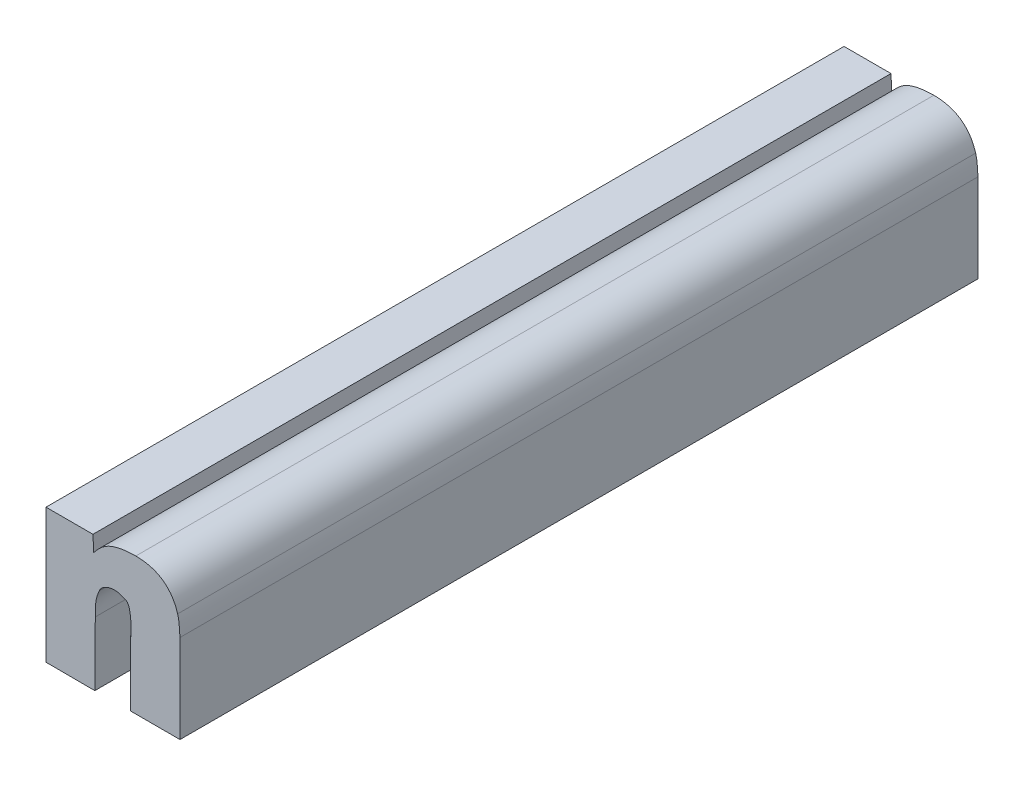
ISO-10303-21;
HEADER;
FILE_DESCRIPTION(('STEP AP214'),'2;1');
FILE_NAME('part.step','',(''),(''),'','','');
FILE_SCHEMA(('AUTOMOTIVE_DESIGN { 1 0 10303 214 1 1 1 1 }'));
ENDSEC;
DATA;
#1=APPLICATION_CONTEXT('core data for automotive mechanical design processes');
#2=APPLICATION_PROTOCOL_DEFINITION('international standard','automotive_design',2000,#1);
#3=PRODUCT_CONTEXT('',#1,'mechanical');
#4=PRODUCT('Part','Part','',(#3));
#5=PRODUCT_RELATED_PRODUCT_CATEGORY('part','',(#4));
#6=PRODUCT_DEFINITION_FORMATION('','',#4);
#7=PRODUCT_DEFINITION_CONTEXT('part definition',#1,'design');
#8=PRODUCT_DEFINITION('design','',#6,#7);
#9=PRODUCT_DEFINITION_SHAPE('','',#8);
#10=(LENGTH_UNIT() NAMED_UNIT(*) SI_UNIT(.MILLI.,.METRE.));
#11=(NAMED_UNIT(*) PLANE_ANGLE_UNIT() SI_UNIT($,.RADIAN.));
#12=(NAMED_UNIT(*) SI_UNIT($,.STERADIAN.) SOLID_ANGLE_UNIT());
#13=UNCERTAINTY_MEASURE_WITH_UNIT(LENGTH_MEASURE(1.E-05),#10,'distance_accuracy_value','');
#14=(GEOMETRIC_REPRESENTATION_CONTEXT(3) GLOBAL_UNCERTAINTY_ASSIGNED_CONTEXT((#13)) GLOBAL_UNIT_ASSIGNED_CONTEXT((#10,
#11,#12)) REPRESENTATION_CONTEXT('',''));
#15=CARTESIAN_POINT('',(0.,0.,0.));
#16=DIRECTION('',(0.,0.,1.));
#17=DIRECTION('',(1.,0.,0.));
#18=AXIS2_PLACEMENT_3D('',#15,#16,#17);
#19=CARTESIAN_POINT('',(1.4074194485679,0.0342091293342742,0.));
#20=DIRECTION('',(-1.,0.,0.));
#21=DIRECTION('',(0.,-1.,0.));
#22=AXIS2_PLACEMENT_3D('',#19,#20,#21);
#23=PLANE('',#22);
#24=DIRECTION('',(0.,-1.,0.));
#25=VECTOR('',#24,1.);
#26=CARTESIAN_POINT('',(1.4074194485679,0.0342091293342742,0.));
#27=LINE('',#26,#25);
#28=CARTESIAN_POINT('',(1.4074194485679,0.0342091293342742,0.));
#29=VERTEX_POINT('',#28);
#30=CARTESIAN_POINT('',(1.4074194485679,0.0173801347136242,0.));
#31=VERTEX_POINT('',#30);
#32=EDGE_CURVE('E11',#29,#31,#27,.T.);
#33=ORIENTED_EDGE('',*,*,#32,.T.);
#34=DIRECTION('',(0.,0.,1.));
#35=VECTOR('',#34,1.);
#36=CARTESIAN_POINT('',(1.4074194485679,0.0173801347136242,0.));
#37=LINE('',#36,#35);
#38=CARTESIAN_POINT('',(1.4074194485679,0.0173801347136242,0.1));
#39=VERTEX_POINT('',#38);
#40=EDGE_CURVE('E24',#31,#39,#37,.T.);
#41=ORIENTED_EDGE('',*,*,#40,.T.);
#42=DIRECTION('',(0.,-1.,0.));
#43=VECTOR('',#42,1.);
#44=CARTESIAN_POINT('',(1.4074194485679,0.0342091293342742,0.1));
#45=LINE('',#44,#43);
#46=CARTESIAN_POINT('',(1.4074194485679,0.0342091293342742,0.1));
#47=VERTEX_POINT('',#46);
#48=EDGE_CURVE('E142',#47,#39,#45,.T.);
#49=ORIENTED_EDGE('',*,*,#48,.F.);
#50=DIRECTION('',(0.,0.,1.));
#51=VECTOR('',#50,1.);
#52=CARTESIAN_POINT('',(1.4074194485679,0.0342091293342742,0.));
#53=LINE('',#52,#51);
#54=EDGE_CURVE('E321',#29,#47,#53,.T.);
#55=ORIENTED_EDGE('',*,*,#54,.F.);
#56=EDGE_LOOP('',(#33,#41,#49,#55));
#57=FACE_BOUND('',#56,.T.);
#58=ADVANCED_FACE('F17',(#57),#23,.T.);
#59=CARTESIAN_POINT('',(1.4133055391579,0.0342091293342742,0.));
#60=DIRECTION('',(0.,1.,0.));
#61=DIRECTION('',(-1.,0.,0.));
#62=AXIS2_PLACEMENT_3D('',#59,#60,#61);
#63=PLANE('',#62);
#64=DIRECTION('',(-1.,0.,0.));
#65=VECTOR('',#64,1.);
#66=CARTESIAN_POINT('',(1.4133055391579,0.0342091293342742,0.));
#67=LINE('',#66,#65);
#68=CARTESIAN_POINT('',(1.4133055391579,0.0342091293342742,0.));
#69=VERTEX_POINT('',#68);
#70=EDGE_CURVE('E318',#69,#29,#67,.T.);
#71=ORIENTED_EDGE('',*,*,#70,.T.);
#72=ORIENTED_EDGE('',*,*,#54,.T.);
#73=DIRECTION('',(-1.,0.,0.));
#74=VECTOR('',#73,1.);
#75=CARTESIAN_POINT('',(1.4133055391579,0.0342091293342742,0.1));
#76=LINE('',#75,#74);
#77=CARTESIAN_POINT('',(1.4133055391579,0.0342091293342742,0.1));
#78=VERTEX_POINT('',#77);
#79=EDGE_CURVE('E316',#78,#47,#76,.T.);
#80=ORIENTED_EDGE('',*,*,#79,.F.);
#81=DIRECTION('',(0.,0.,1.));
#82=VECTOR('',#81,1.);
#83=CARTESIAN_POINT('',(1.4133055391579,0.0342091293342742,0.));
#84=LINE('',#83,#82);
#85=EDGE_CURVE('E313',#69,#78,#84,.T.);
#86=ORIENTED_EDGE('',*,*,#85,.F.);
#87=EDGE_LOOP('',(#71,#72,#80,#86));
#88=FACE_BOUND('',#87,.T.);
#89=ADVANCED_FACE('F359',(#88),#63,.T.);
#90=CARTESIAN_POINT('',(1.4133925214156,0.0322548210339742,0.));
#91=DIRECTION('',(0.99901099030473,0.0444639320164345,0.));
#92=DIRECTION('',(-0.0444639320164345,0.99901099030473,0.));
#93=AXIS2_PLACEMENT_3D('',#90,#91,#92);
#94=PLANE('',#93);
#95=DIRECTION('',(-0.0444639320164345,0.99901099030473,0.));
#96=VECTOR('',#95,1.);
#97=CARTESIAN_POINT('',(1.4133925214156,0.0322548210339742,0.));
#98=LINE('',#97,#96);
#99=CARTESIAN_POINT('',(1.4133925214156,0.0322548210339742,0.));
#100=VERTEX_POINT('',#99);
#101=EDGE_CURVE('E310',#100,#69,#98,.T.);
#102=ORIENTED_EDGE('',*,*,#101,.T.);
#103=ORIENTED_EDGE('',*,*,#85,.T.);
#104=DIRECTION('',(-0.0444639320164345,0.99901099030473,0.));
#105=VECTOR('',#104,1.);
#106=CARTESIAN_POINT('',(1.4133925214156,0.0322548210339742,0.1));
#107=LINE('',#106,#105);
#108=CARTESIAN_POINT('',(1.4133925214156,0.0322548210339742,0.1));
#109=VERTEX_POINT('',#108);
#110=EDGE_CURVE('E307',#109,#78,#107,.T.);
#111=ORIENTED_EDGE('',*,*,#110,.F.);
#112=DIRECTION('',(0.,0.,1.));
#113=VECTOR('',#112,1.);
#114=CARTESIAN_POINT('',(1.4133925214156,0.0322548210339742,0.));
#115=LINE('',#114,#113);
#116=EDGE_CURVE('E301',#100,#109,#115,.T.);
#117=ORIENTED_EDGE('',*,*,#116,.F.);
#118=EDGE_LOOP('',(#102,#103,#111,#117));
#119=FACE_BOUND('',#118,.T.);
#120=ADVANCED_FACE('F356',(#119),#94,.T.);
#121=CARTESIAN_POINT('',(1.4186697063569,0.0345338787482742,0.));
#122=CARTESIAN_POINT('',(1.4186697063569,0.0345338787482742,0.1));
#123=CARTESIAN_POINT('',(1.4151612494587,0.0345338788009834,0.));
#124=CARTESIAN_POINT('',(1.4151612494587,0.0345338788009834,0.1));
#125=CARTESIAN_POINT('',(1.4142043989003,0.0332493718588188,0.));
#126=CARTESIAN_POINT('',(1.4142043989003,0.0332493718588188,0.1));
#127=CARTESIAN_POINT('',(1.4133925214156,0.0322548210339742,0.));
#128=CARTESIAN_POINT('',(1.4133925214156,0.0322548210339742,0.1));
#129=B_SPLINE_SURFACE_WITH_KNOTS('',3,1,((#121,#122),(#123,#124),(#125,#126),(#127,#128)),
.UNSPECIFIED.,.F.,.F.,.F.,(4,4),(2,2),(0.,1.),(0.,0.01),.UNSPECIFIED.);
#130=CARTESIAN_POINT('',(1.4186697063569,0.0345338787482742,0.));
#131=CARTESIAN_POINT('',(1.4151612494587,0.0345338788009834,0.));
#132=CARTESIAN_POINT('',(1.4142043989003,0.0332493718588188,0.));
#133=CARTESIAN_POINT('',(1.4133925214156,0.0322548210339742,0.));
#134=B_SPLINE_CURVE_WITH_KNOTS('',3,(#130,#131,#132,#133),.UNSPECIFIED.,.F.,.F.,(4,4),(0.,1.),.UNSPECIFIED.);
#135=CARTESIAN_POINT('',(1.4186697063569,0.0345338787482742,0.));
#136=VERTEX_POINT('',#135);
#137=EDGE_CURVE('E293',#136,#100,#134,.T.);
#138=CARTESIAN_POINT('',(1.4186697063569,0.0345338787482742,0.1));
#139=CARTESIAN_POINT('',(1.4151612494587,0.0345338788009834,0.1));
#140=CARTESIAN_POINT('',(1.4142043989003,0.0332493718588188,0.1));
#141=CARTESIAN_POINT('',(1.4133925214156,0.0322548210339742,0.1));
#142=B_SPLINE_CURVE_WITH_KNOTS('',3,(#138,#139,#140,#141),.UNSPECIFIED.,.F.,.F.,(4,4),(0.,1.),.UNSPECIFIED.);
#143=CARTESIAN_POINT('',(1.4186697063569,0.0345338787482742,0.1));
#144=VERTEX_POINT('',#143);
#145=EDGE_CURVE('E288',#144,#109,#142,.T.);
#146=DIRECTION('',(0.,0.,1.));
#147=VECTOR('',#146,1.);
#148=CARTESIAN_POINT('',(1.4186697063569,0.0345338787482742,0.));
#149=LINE('',#148,#147);
#150=EDGE_CURVE('E282',#136,#144,#149,.T.);
#151=ORIENTED_EDGE('',*,*,#137,.T.);
#152=ORIENTED_EDGE('',*,*,#116,.T.);
#153=ORIENTED_EDGE('',*,*,#145,.F.);
#154=ORIENTED_EDGE('',*,*,#150,.F.);
#155=EDGE_LOOP('',(#151,#152,#153,#154));
#156=FACE_BOUND('',#155,.T.);
#157=ADVANCED_FACE('F353',(#156),#129,.T.);
#158=CARTESIAN_POINT('',(1.4239178958859,0.0308775359636242,0.));
#159=CARTESIAN_POINT('',(1.4239178958859,0.0308775359636242,0.1));
#160=CARTESIAN_POINT('',(1.4231350098046,0.033461042522976,0.));
#161=CARTESIAN_POINT('',(1.4231350098046,0.033461042522976,0.1));
#162=CARTESIAN_POINT('',(1.4211923112092,0.0345338787482763,0.));
#163=CARTESIAN_POINT('',(1.4211923112092,0.0345338787482763,0.1));
#164=CARTESIAN_POINT('',(1.4186697063569,0.0345338787482742,0.));
#165=CARTESIAN_POINT('',(1.4186697063569,0.0345338787482742,0.1));
#166=B_SPLINE_SURFACE_WITH_KNOTS('',3,1,((#158,#159),(#160,#161),(#162,#163),(#164,#165)),
.UNSPECIFIED.,.F.,.F.,.F.,(4,4),(2,2),(0.,1.),(0.,0.01),.UNSPECIFIED.);
#167=CARTESIAN_POINT('',(1.4239178958859,0.0308775359636242,0.));
#168=CARTESIAN_POINT('',(1.4231350098046,0.033461042522976,0.));
#169=CARTESIAN_POINT('',(1.4211923112092,0.0345338787482763,0.));
#170=CARTESIAN_POINT('',(1.4186697063569,0.0345338787482742,0.));
#171=B_SPLINE_CURVE_WITH_KNOTS('',3,(#167,#168,#169,#170),.UNSPECIFIED.,.F.,.F.,(4,4),(0.,1.),.UNSPECIFIED.);
#172=CARTESIAN_POINT('',(1.4239178958859,0.0308775359636242,0.));
#173=VERTEX_POINT('',#172);
#174=EDGE_CURVE('E274',#173,#136,#171,.T.);
#175=CARTESIAN_POINT('',(1.4239178958859,0.0308775359636242,0.1));
#176=CARTESIAN_POINT('',(1.4231350098046,0.033461042522976,0.1));
#177=CARTESIAN_POINT('',(1.4211923112092,0.0345338787482763,0.1));
#178=CARTESIAN_POINT('',(1.4186697063569,0.0345338787482742,0.1));
#179=B_SPLINE_CURVE_WITH_KNOTS('',3,(#175,#176,#177,#178),.UNSPECIFIED.,.F.,.F.,(4,4),(0.,1.),.UNSPECIFIED.);
#180=CARTESIAN_POINT('',(1.4239178958859,0.0308775359636242,0.1));
#181=VERTEX_POINT('',#180);
#182=EDGE_CURVE('E269',#181,#144,#179,.T.);
#183=DIRECTION('',(0.,0.,1.));
#184=VECTOR('',#183,1.);
#185=CARTESIAN_POINT('',(1.4239178958859,0.0308775359636242,0.));
#186=LINE('',#185,#184);
#187=EDGE_CURVE('E263',#173,#181,#186,.T.);
#188=ORIENTED_EDGE('',*,*,#174,.T.);
#189=ORIENTED_EDGE('',*,*,#150,.T.);
#190=ORIENTED_EDGE('',*,*,#182,.F.);
#191=ORIENTED_EDGE('',*,*,#187,.F.);
#192=EDGE_LOOP('',(#188,#189,#190,#191));
#193=FACE_BOUND('',#192,.T.);
#194=ADVANCED_FACE('F350',(#193),#166,.T.);
#195=CARTESIAN_POINT('',(1.4242078460299,0.0284593130039617,0.));
#196=CARTESIAN_POINT('',(1.4242078460299,0.0284593130039617,0.1));
#197=CARTESIAN_POINT('',(1.4241208578032,0.0297989098082781,0.));
#198=CARTESIAN_POINT('',(1.4241208578032,0.0297989098082781,0.1));
#199=CARTESIAN_POINT('',(1.4240918663702,0.0302251401809761,0.));
#200=CARTESIAN_POINT('',(1.4240918663702,0.0302251401809761,0.1));
#201=CARTESIAN_POINT('',(1.4239178958859,0.0308775359636242,0.));
#202=CARTESIAN_POINT('',(1.4239178958859,0.0308775359636242,0.1));
#203=B_SPLINE_SURFACE_WITH_KNOTS('',3,1,((#195,#196),(#197,#198),(#199,#200),(#201,#202)),
.UNSPECIFIED.,.F.,.F.,.F.,(4,4),(2,2),(0.,1.),(0.,0.01),.UNSPECIFIED.);
#204=CARTESIAN_POINT('',(1.4242078460299,0.0284593130039617,0.));
#205=CARTESIAN_POINT('',(1.4241208578032,0.0297989098082781,0.));
#206=CARTESIAN_POINT('',(1.4240918663702,0.0302251401809761,0.));
#207=CARTESIAN_POINT('',(1.4239178958859,0.0308775359636242,0.));
#208=B_SPLINE_CURVE_WITH_KNOTS('',3,(#204,#205,#206,#207),.UNSPECIFIED.,.F.,.F.,(4,4),(0.,1.),.UNSPECIFIED.);
#209=CARTESIAN_POINT('',(1.4242078460299,0.0284593130039617,0.));
#210=VERTEX_POINT('',#209);
#211=EDGE_CURVE('E255',#210,#173,#208,.T.);
#212=CARTESIAN_POINT('',(1.4242078460299,0.0284593130039617,0.1));
#213=CARTESIAN_POINT('',(1.4241208578032,0.0297989098082781,0.1));
#214=CARTESIAN_POINT('',(1.4240918663702,0.0302251401809761,0.1));
#215=CARTESIAN_POINT('',(1.4239178958859,0.0308775359636242,0.1));
#216=B_SPLINE_CURVE_WITH_KNOTS('',3,(#212,#213,#214,#215),.UNSPECIFIED.,.F.,.F.,(4,4),(0.,1.),.UNSPECIFIED.);
#217=CARTESIAN_POINT('',(1.4242078460299,0.0284593130039617,0.1));
#218=VERTEX_POINT('',#217);
#219=EDGE_CURVE('E250',#218,#181,#216,.T.);
#220=DIRECTION('',(0.,0.,1.));
#221=VECTOR('',#220,1.);
#222=CARTESIAN_POINT('',(1.4242078460299,0.0284593130039617,0.));
#223=LINE('',#222,#221);
#224=EDGE_CURVE('E247',#210,#218,#223,.T.);
#225=ORIENTED_EDGE('',*,*,#211,.T.);
#226=ORIENTED_EDGE('',*,*,#187,.T.);
#227=ORIENTED_EDGE('',*,*,#219,.F.);
#228=ORIENTED_EDGE('',*,*,#224,.F.);
#229=EDGE_LOOP('',(#225,#226,#227,#228));
#230=FACE_BOUND('',#229,.T.);
#231=ADVANCED_FACE('F347',(#230),#203,.T.);
#232=CARTESIAN_POINT('',(1.4242078460299,0.0173801347136242,0.));
#233=DIRECTION('',(1.,0.,0.));
#234=DIRECTION('',(0.,1.,0.));
#235=AXIS2_PLACEMENT_3D('',#232,#233,#234);
#236=PLANE('',#235);
#237=DIRECTION('',(0.,1.,0.));
#238=VECTOR('',#237,1.);
#239=CARTESIAN_POINT('',(1.4242078460299,0.0173801347136242,0.));
#240=LINE('',#239,#238);
#241=CARTESIAN_POINT('',(1.4242078460299,0.0173801347136242,0.));
#242=VERTEX_POINT('',#241);
#243=EDGE_CURVE('E244',#242,#210,#240,.T.);
#244=ORIENTED_EDGE('',*,*,#243,.T.);
#245=ORIENTED_EDGE('',*,*,#224,.T.);
#246=DIRECTION('',(0.,1.,0.));
#247=VECTOR('',#246,1.);
#248=CARTESIAN_POINT('',(1.4242078460299,0.0173801347136242,0.1));
#249=LINE('',#248,#247);
#250=CARTESIAN_POINT('',(1.4242078460299,0.0173801347136242,0.1));
#251=VERTEX_POINT('',#250);
#252=EDGE_CURVE('E241',#251,#218,#249,.T.);
#253=ORIENTED_EDGE('',*,*,#252,.F.);
#254=DIRECTION('',(0.,0.,1.));
#255=VECTOR('',#254,1.);
#256=CARTESIAN_POINT('',(1.4242078460299,0.0173801347136242,0.));
#257=LINE('',#256,#255);
#258=EDGE_CURVE('E238',#242,#251,#257,.T.);
#259=ORIENTED_EDGE('',*,*,#258,.F.);
#260=EDGE_LOOP('',(#244,#245,#253,#259));
#261=FACE_BOUND('',#260,.T.);
#262=ADVANCED_FACE('F344',(#261),#236,.T.);
#263=CARTESIAN_POINT('',(1.4180318052959,0.0173859266332742,0.));
#264=DIRECTION('',(-0.000937804226449597,-0.99999956026152,0.));
#265=DIRECTION('',(0.99999956026152,-0.000937804226449597,0.));
#266=AXIS2_PLACEMENT_3D('',#263,#264,#265);
#267=PLANE('',#266);
#268=DIRECTION('',(0.99999956026152,-0.000937804226449597,0.));
#269=VECTOR('',#268,1.);
#270=CARTESIAN_POINT('',(1.4180318052959,0.0173859266332742,0.));
#271=LINE('',#270,#269);
#272=CARTESIAN_POINT('',(1.4180318052959,0.0173859266332742,0.));
#273=VERTEX_POINT('',#272);
#274=EDGE_CURVE('E235',#273,#242,#271,.T.);
#275=ORIENTED_EDGE('',*,*,#274,.T.);
#276=ORIENTED_EDGE('',*,*,#258,.T.);
#277=DIRECTION('',(0.99999956026152,-0.000937804226449597,0.));
#278=VECTOR('',#277,1.);
#279=CARTESIAN_POINT('',(1.4180318052959,0.0173859266332742,0.1));
#280=LINE('',#279,#278);
#281=CARTESIAN_POINT('',(1.4180318052959,0.0173859266332742,0.1));
#282=VERTEX_POINT('',#281);
#283=EDGE_CURVE('E232',#282,#251,#280,.T.);
#284=ORIENTED_EDGE('',*,*,#283,.F.);
#285=DIRECTION('',(0.,0.,1.));
#286=VECTOR('',#285,1.);
#287=CARTESIAN_POINT('',(1.4180318052959,0.0173859266332742,0.));
#288=LINE('',#287,#286);
#289=EDGE_CURVE('E229',#273,#282,#288,.T.);
#290=ORIENTED_EDGE('',*,*,#289,.F.);
#291=EDGE_LOOP('',(#275,#276,#284,#290));
#292=FACE_BOUND('',#291,.T.);
#293=ADVANCED_FACE('F341',(#292),#267,.T.);
#294=CARTESIAN_POINT('',(1.4180318052959,0.0255684626346287,0.));
#295=DIRECTION('',(-1.,0.,0.));
#296=DIRECTION('',(0.,-1.,0.));
#297=AXIS2_PLACEMENT_3D('',#294,#295,#296);
#298=PLANE('',#297);
#299=DIRECTION('',(0.,-1.,0.));
#300=VECTOR('',#299,1.);
#301=CARTESIAN_POINT('',(1.4180318052959,0.0255684626346287,0.));
#302=LINE('',#301,#300);
#303=CARTESIAN_POINT('',(1.4180318052959,0.0255684626346287,0.));
#304=VERTEX_POINT('',#303);
#305=EDGE_CURVE('E226',#304,#273,#302,.T.);
#306=ORIENTED_EDGE('',*,*,#305,.T.);
#307=ORIENTED_EDGE('',*,*,#289,.T.);
#308=DIRECTION('',(0.,-1.,0.));
#309=VECTOR('',#308,1.);
#310=CARTESIAN_POINT('',(1.4180318052959,0.0255684626346287,0.1));
#311=LINE('',#310,#309);
#312=CARTESIAN_POINT('',(1.4180318052959,0.0255684626346287,0.1));
#313=VERTEX_POINT('',#312);
#314=EDGE_CURVE('E223',#313,#282,#311,.T.);
#315=ORIENTED_EDGE('',*,*,#314,.F.);
#316=DIRECTION('',(0.,0.,1.));
#317=VECTOR('',#316,1.);
#318=CARTESIAN_POINT('',(1.4180318052959,0.0255684626346287,0.));
#319=LINE('',#318,#317);
#320=EDGE_CURVE('E217',#304,#313,#319,.T.);
#321=ORIENTED_EDGE('',*,*,#320,.F.);
#322=EDGE_LOOP('',(#306,#307,#315,#321));
#323=FACE_BOUND('',#322,.T.);
#324=ADVANCED_FACE('F338',(#323),#298,.T.);
#325=CARTESIAN_POINT('',(1.4174518930699,0.0291030179226287,0.));
#326=CARTESIAN_POINT('',(1.4174518930699,0.0291030179226287,0.1));
#327=CARTESIAN_POINT('',(1.4183217614089,0.02869128028196,0.));
#328=CARTESIAN_POINT('',(1.4183217614089,0.02869128028196,0.1));
#329=CARTESIAN_POINT('',(1.4180318052959,0.0246000142709589,0.));
#330=CARTESIAN_POINT('',(1.4180318052959,0.0246000142709589,0.1));
#331=CARTESIAN_POINT('',(1.4180318052959,0.0255684626346287,0.));
#332=CARTESIAN_POINT('',(1.4180318052959,0.0255684626346287,0.1));
#333=B_SPLINE_SURFACE_WITH_KNOTS('',3,1,((#325,#326),(#327,#328),(#329,#330),(#331,#332)),
.UNSPECIFIED.,.F.,.F.,.F.,(4,4),(2,2),(0.,1.),(0.,0.01),.UNSPECIFIED.);
#334=CARTESIAN_POINT('',(1.4174518930699,0.0291030179226287,0.));
#335=CARTESIAN_POINT('',(1.4183217614089,0.02869128028196,0.));
#336=CARTESIAN_POINT('',(1.4180318052959,0.0246000142709589,0.));
#337=CARTESIAN_POINT('',(1.4180318052959,0.0255684626346287,0.));
#338=B_SPLINE_CURVE_WITH_KNOTS('',3,(#334,#335,#336,#337),.UNSPECIFIED.,.F.,.F.,(4,4),(0.,1.),.UNSPECIFIED.);
#339=CARTESIAN_POINT('',(1.4174518930699,0.0291030179226287,0.));
#340=VERTEX_POINT('',#339);
#341=EDGE_CURVE('E209',#340,#304,#338,.T.);
#342=CARTESIAN_POINT('',(1.4174518930699,0.0291030179226287,0.1));
#343=CARTESIAN_POINT('',(1.4183217614089,0.02869128028196,0.1));
#344=CARTESIAN_POINT('',(1.4180318052959,0.0246000142709589,0.1));
#345=CARTESIAN_POINT('',(1.4180318052959,0.0255684626346287,0.1));
#346=B_SPLINE_CURVE_WITH_KNOTS('',3,(#342,#343,#344,#345),.UNSPECIFIED.,.F.,.F.,(4,4),(0.,1.),.UNSPECIFIED.);
#347=CARTESIAN_POINT('',(1.4174518930699,0.0291030179226287,0.1));
#348=VERTEX_POINT('',#347);
#349=EDGE_CURVE('E204',#348,#313,#346,.T.);
#350=DIRECTION('',(0.,0.,1.));
#351=VECTOR('',#350,1.);
#352=CARTESIAN_POINT('',(1.4174518930699,0.0291030179226287,0.));
#353=LINE('',#352,#351);
#354=EDGE_CURVE('E198',#340,#348,#353,.T.);
#355=CARTESIAN_POINT('',(1.4174518930699,0.0291030179226287,0.));
#356=CARTESIAN_POINT('',(1.4174518930699,0.0291030179226287,0.1));
#357=CARTESIAN_POINT('',(1.4183217614089,0.02869128028196,0.));
#358=CARTESIAN_POINT('',(1.4183217614089,0.02869128028196,0.1));
#359=CARTESIAN_POINT('',(1.4180318052959,0.0246000142709589,0.));
#360=CARTESIAN_POINT('',(1.4180318052959,0.0246000142709589,0.1));
#361=CARTESIAN_POINT('',(1.4180318052959,0.0255684626346287,0.));
#362=CARTESIAN_POINT('',(1.4180318052959,0.0255684626346287,0.1));
#363=CARTESIAN_POINT('',(1.4180318052959,0.025646906952086,0.));
#364=CARTESIAN_POINT('',(1.4180318052959,0.025646906952086,0.1));
#365=CARTESIAN_POINT('',(1.4180318052959,0.0257253512695432,0.));
#366=CARTESIAN_POINT('',(1.4180318052959,0.0257253512695432,0.1));
#367=CARTESIAN_POINT('',(1.4180318052959,0.0258037955870005,0.));
#368=CARTESIAN_POINT('',(1.4180318052959,0.0258037955870005,0.1));
#369=B_SPLINE_SURFACE_WITH_KNOTS('',3,1,((#355,#356),(#357,#358),(#359,#360),(#361,#362),(#363,
#364),(#365,#366),(#367,#368)),.UNSPECIFIED.,.F.,.F.,.F.,(4,3,4),(2,2),(0.,1.,1.081),(0.,0.01),.UNSPECIFIED.);
#370=ORIENTED_EDGE('',*,*,#341,.T.);
#371=ORIENTED_EDGE('',*,*,#320,.T.);
#372=ORIENTED_EDGE('',*,*,#349,.F.);
#373=ORIENTED_EDGE('',*,*,#354,.F.);
#374=EDGE_LOOP('',(#370,#371,#372,#373));
#375=FACE_BOUND('',#374,.T.);
#376=ADVANCED_FACE('F335',(#375),#369,.T.);
#377=CARTESIAN_POINT('',(1.4159731210719,0.0295089477262952,0.));
#378=CARTESIAN_POINT('',(1.4159731210719,0.0295089477262952,0.1));
#379=CARTESIAN_POINT('',(1.4166110221329,0.029523452396294,0.));
#380=CARTESIAN_POINT('',(1.4166110221329,0.029523452396294,0.1));
#381=CARTESIAN_POINT('',(1.417161942926,0.0292392921822978,0.));
#382=CARTESIAN_POINT('',(1.417161942926,0.0292392921822978,0.1));
#383=CARTESIAN_POINT('',(1.4174518930699,0.0291030179226287,0.));
#384=CARTESIAN_POINT('',(1.4174518930699,0.0291030179226287,0.1));
#385=B_SPLINE_SURFACE_WITH_KNOTS('',3,1,((#377,#378),(#379,#380),(#381,#382),(#383,#384)),
.UNSPECIFIED.,.F.,.F.,.F.,(4,4),(2,2),(0.,1.),(0.,0.01),.UNSPECIFIED.);
#386=CARTESIAN_POINT('',(1.4159731210719,0.0295089477262952,0.));
#387=CARTESIAN_POINT('',(1.4166110221329,0.029523452396294,0.));
#388=CARTESIAN_POINT('',(1.417161942926,0.0292392921822978,0.));
#389=CARTESIAN_POINT('',(1.4174518930699,0.0291030179226287,0.));
#390=B_SPLINE_CURVE_WITH_KNOTS('',3,(#386,#387,#388,#389),.UNSPECIFIED.,.F.,.F.,(4,4),(0.,1.),.UNSPECIFIED.);
#391=CARTESIAN_POINT('',(1.4159731210719,0.0295089477262952,0.));
#392=VERTEX_POINT('',#391);
#393=EDGE_CURVE('E190',#392,#340,#390,.T.);
#394=CARTESIAN_POINT('',(1.4159731210719,0.0295089477262952,0.1));
#395=CARTESIAN_POINT('',(1.4166110221329,0.029523452396294,0.1));
#396=CARTESIAN_POINT('',(1.417161942926,0.0292392921822978,0.1));
#397=CARTESIAN_POINT('',(1.4174518930699,0.0291030179226287,0.1));
#398=B_SPLINE_CURVE_WITH_KNOTS('',3,(#394,#395,#396,#397),.UNSPECIFIED.,.F.,.F.,(4,4),(0.,1.),.UNSPECIFIED.);
#399=CARTESIAN_POINT('',(1.4159731210719,0.0295089477262952,0.1));
#400=VERTEX_POINT('',#399);
#401=EDGE_CURVE('E185',#400,#348,#398,.T.);
#402=DIRECTION('',(0.,0.,1.));
#403=VECTOR('',#402,1.);
#404=CARTESIAN_POINT('',(1.4159731210719,0.0295089477262952,0.));
#405=LINE('',#404,#403);
#406=EDGE_CURVE('E179',#392,#400,#405,.T.);
#407=ORIENTED_EDGE('',*,*,#393,.T.);
#408=ORIENTED_EDGE('',*,*,#354,.T.);
#409=ORIENTED_EDGE('',*,*,#401,.F.);
#410=ORIENTED_EDGE('',*,*,#406,.F.);
#411=EDGE_LOOP('',(#407,#408,#409,#410));
#412=FACE_BOUND('',#411,.T.);
#413=ADVANCED_FACE('F332',(#412),#385,.T.);
#414=CARTESIAN_POINT('',(1.4140884133013,0.0284593130039617,0.));
#415=CARTESIAN_POINT('',(1.4140884133013,0.0284593130039617,0.1));
#416=CARTESIAN_POINT('',(1.414349372018,0.0291291083974326,0.));
#417=CARTESIAN_POINT('',(1.414349372018,0.0291291083974326,0.1));
#418=CARTESIAN_POINT('',(1.4152192383618,0.0294944549830648,0.));
#419=CARTESIAN_POINT('',(1.4152192383618,0.0294944549830648,0.1));
#420=CARTESIAN_POINT('',(1.4159731210719,0.0295089477262952,0.));
#421=CARTESIAN_POINT('',(1.4159731210719,0.0295089477262952,0.1));
#422=B_SPLINE_SURFACE_WITH_KNOTS('',3,1,((#414,#415),(#416,#417),(#418,#419),(#420,#421)),
.UNSPECIFIED.,.F.,.F.,.F.,(4,4),(2,2),(0.,1.),(0.,0.01),.UNSPECIFIED.);
#423=CARTESIAN_POINT('',(1.4140884133013,0.0284593130039617,0.));
#424=CARTESIAN_POINT('',(1.414349372018,0.0291291083974326,0.));
#425=CARTESIAN_POINT('',(1.4152192383618,0.0294944549830648,0.));
#426=CARTESIAN_POINT('',(1.4159731210719,0.0295089477262952,0.));
#427=B_SPLINE_CURVE_WITH_KNOTS('',3,(#423,#424,#425,#426),.UNSPECIFIED.,.F.,.F.,(4,4),(0.,1.),.UNSPECIFIED.);
#428=CARTESIAN_POINT('',(1.4140884133013,0.0284593130039617,0.));
#429=VERTEX_POINT('',#428);
#430=EDGE_CURVE('E171',#429,#392,#427,.T.);
#431=CARTESIAN_POINT('',(1.4140884133013,0.0284593130039617,0.1));
#432=CARTESIAN_POINT('',(1.414349372018,0.0291291083974326,0.1));
#433=CARTESIAN_POINT('',(1.4152192383618,0.0294944549830648,0.1));
#434=CARTESIAN_POINT('',(1.4159731210719,0.0295089477262952,0.1));
#435=B_SPLINE_CURVE_WITH_KNOTS('',3,(#431,#432,#433,#434),.UNSPECIFIED.,.F.,.F.,(4,4),(0.,1.),.UNSPECIFIED.);
#436=CARTESIAN_POINT('',(1.4140884133013,0.0284593130039617,0.1));
#437=VERTEX_POINT('',#436);
#438=EDGE_CURVE('E166',#437,#400,#435,.T.);
#439=DIRECTION('',(0.,0.,1.));
#440=VECTOR('',#439,1.);
#441=CARTESIAN_POINT('',(1.4140884133013,0.0284593130039617,0.));
#442=LINE('',#441,#440);
#443=EDGE_CURVE('E160',#429,#437,#442,.T.);
#444=ORIENTED_EDGE('',*,*,#430,.T.);
#445=ORIENTED_EDGE('',*,*,#406,.T.);
#446=ORIENTED_EDGE('',*,*,#438,.F.);
#447=ORIENTED_EDGE('',*,*,#443,.F.);
#448=EDGE_LOOP('',(#444,#445,#446,#447));
#449=FACE_BOUND('',#448,.T.);
#450=ADVANCED_FACE('F329',(#449),#422,.T.);
#451=CARTESIAN_POINT('',(1.4135954932813,0.0253857893482952,0.));
#452=CARTESIAN_POINT('',(1.4135954932813,0.0253857893482952,0.1));
#453=CARTESIAN_POINT('',(1.4135664958997,0.0270849288598499,0.));
#454=CARTESIAN_POINT('',(1.4135664958997,0.0270849288598499,0.1));
#455=CARTESIAN_POINT('',(1.4137404663758,0.0276416395854407,0.));
#456=CARTESIAN_POINT('',(1.4137404663758,0.0276416395854407,0.1));
#457=CARTESIAN_POINT('',(1.4140884133013,0.0284593130039617,0.));
#458=CARTESIAN_POINT('',(1.4140884133013,0.0284593130039617,0.1));
#459=B_SPLINE_SURFACE_WITH_KNOTS('',3,1,((#451,#452),(#453,#454),(#455,#456),(#457,#458)),
.UNSPECIFIED.,.F.,.F.,.F.,(4,4),(2,2),(0.,1.),(0.,0.01),.UNSPECIFIED.);
#460=CARTESIAN_POINT('',(1.4135954932813,0.0253857893482952,0.));
#461=CARTESIAN_POINT('',(1.4135664958997,0.0270849288598499,0.));
#462=CARTESIAN_POINT('',(1.4137404663758,0.0276416395854407,0.));
#463=CARTESIAN_POINT('',(1.4140884133013,0.0284593130039617,0.));
#464=B_SPLINE_CURVE_WITH_KNOTS('',3,(#460,#461,#462,#463),.UNSPECIFIED.,.F.,.F.,(4,4),(0.,1.),.UNSPECIFIED.);
#465=CARTESIAN_POINT('',(1.4135954932813,0.0253857893482952,0.));
#466=VERTEX_POINT('',#465);
#467=EDGE_CURVE('E152',#466,#429,#464,.T.);
#468=CARTESIAN_POINT('',(1.4135954932813,0.0253857893482952,0.1));
#469=CARTESIAN_POINT('',(1.4135664958997,0.0270849288598499,0.1));
#470=CARTESIAN_POINT('',(1.4137404663758,0.0276416395854407,0.1));
#471=CARTESIAN_POINT('',(1.4140884133013,0.0284593130039617,0.1));
#472=B_SPLINE_CURVE_WITH_KNOTS('',3,(#468,#469,#470,#471),.UNSPECIFIED.,.F.,.F.,(4,4),(0.,1.),.UNSPECIFIED.);
#473=CARTESIAN_POINT('',(1.4135954932813,0.0253857893482952,0.1));
#474=VERTEX_POINT('',#473);
#475=EDGE_CURVE('E148',#474,#437,#472,.T.);
#476=DIRECTION('',(0.,0.,1.));
#477=VECTOR('',#476,1.);
#478=CARTESIAN_POINT('',(1.4135954932813,0.0253857893482952,0.));
#479=LINE('',#478,#477);
#480=EDGE_CURVE('E127',#466,#474,#479,.T.);
#481=ORIENTED_EDGE('',*,*,#467,.T.);
#482=ORIENTED_EDGE('',*,*,#443,.T.);
#483=ORIENTED_EDGE('',*,*,#475,.F.);
#484=ORIENTED_EDGE('',*,*,#480,.F.);
#485=EDGE_LOOP('',(#481,#482,#483,#484));
#486=FACE_BOUND('',#485,.T.);
#487=ADVANCED_FACE('F327',(#486),#459,.T.);
#488=CARTESIAN_POINT('',(1.4135374984773,0.0173540322766242,0.));
#489=DIRECTION('',(0.999973931858869,-0.0072204987856916,0.));
#490=DIRECTION('',(0.0072204987856916,0.999973931858869,0.));
#491=AXIS2_PLACEMENT_3D('',#488,#489,#490);
#492=PLANE('',#491);
#493=DIRECTION('',(0.0072204987856916,0.999973931858869,0.));
#494=VECTOR('',#493,1.);
#495=CARTESIAN_POINT('',(1.4135374984773,0.0173540322766242,0.));
#496=LINE('',#495,#494);
#497=CARTESIAN_POINT('',(1.4135374984773,0.0173540322766242,0.));
#498=VERTEX_POINT('',#497);
#499=EDGE_CURVE('E131',#498,#466,#496,.T.);
#500=ORIENTED_EDGE('',*,*,#499,.T.);
#501=ORIENTED_EDGE('',*,*,#480,.T.);
#502=DIRECTION('',(0.0072204987856916,0.999973931858869,0.));
#503=VECTOR('',#502,1.);
#504=CARTESIAN_POINT('',(1.4135374984773,0.0173540322766242,0.1));
#505=LINE('',#504,#503);
#506=CARTESIAN_POINT('',(1.4135374984773,0.0173540322766242,0.1));
#507=VERTEX_POINT('',#506);
#508=EDGE_CURVE('E120',#507,#474,#505,.T.);
#509=ORIENTED_EDGE('',*,*,#508,.F.);
#510=DIRECTION('',(0.,0.,1.));
#511=VECTOR('',#510,1.);
#512=CARTESIAN_POINT('',(1.4135374984773,0.0173540322766242,0.));
#513=LINE('',#512,#511);
#514=EDGE_CURVE('E124',#498,#507,#513,.T.);
#515=ORIENTED_EDGE('',*,*,#514,.F.);
#516=EDGE_LOOP('',(#500,#501,#509,#515));
#517=FACE_BOUND('',#516,.T.);
#518=ADVANCED_FACE('F123',(#517),#492,.T.);
#519=CARTESIAN_POINT('',(1.4074194485679,0.0173801347136242,0.));
#520=DIRECTION('',(-0.0042664247305015,-0.999990898768593,0.));
#521=DIRECTION('',(0.999990898768593,-0.0042664247305015,0.));
#522=AXIS2_PLACEMENT_3D('',#519,#520,#521);
#523=PLANE('',#522);
#524=DIRECTION('',(0.999990898768593,-0.0042664247305015,0.));
#525=VECTOR('',#524,1.);
#526=CARTESIAN_POINT('',(1.4074194485679,0.0173801347136242,0.));
#527=LINE('',#526,#525);
#528=EDGE_CURVE('E137',#31,#498,#527,.T.);
#529=ORIENTED_EDGE('',*,*,#528,.T.);
#530=ORIENTED_EDGE('',*,*,#514,.T.);
#531=DIRECTION('',(0.999990898768593,-0.0042664247305015,0.));
#532=VECTOR('',#531,1.);
#533=CARTESIAN_POINT('',(1.4074194485679,0.0173801347136242,0.1));
#534=LINE('',#533,#532);
#535=EDGE_CURVE('E136',#39,#507,#534,.T.);
#536=ORIENTED_EDGE('',*,*,#535,.F.);
#537=ORIENTED_EDGE('',*,*,#40,.F.);
#538=EDGE_LOOP('',(#529,#530,#536,#537));
#539=FACE_BOUND('',#538,.T.);
#540=ADVANCED_FACE('F135',(#539),#523,.T.);
#541=CARTESIAN_POINT('',(1.4153622949474,0.0252864361806949,0.1));
#542=DIRECTION('',(0.,0.,1.));
#543=DIRECTION('',(1.,0.,0.));
#544=AXIS2_PLACEMENT_3D('',#541,#542,#543);
#545=PLANE('',#544);
#546=ORIENTED_EDGE('',*,*,#535,.T.);
#547=ORIENTED_EDGE('',*,*,#508,.T.);
#548=ORIENTED_EDGE('',*,*,#475,.T.);
#549=ORIENTED_EDGE('',*,*,#438,.T.);
#550=ORIENTED_EDGE('',*,*,#401,.T.);
#551=ORIENTED_EDGE('',*,*,#349,.T.);
#552=ORIENTED_EDGE('',*,*,#314,.T.);
#553=ORIENTED_EDGE('',*,*,#283,.T.);
#554=ORIENTED_EDGE('',*,*,#252,.T.);
#555=ORIENTED_EDGE('',*,*,#219,.T.);
#556=ORIENTED_EDGE('',*,*,#182,.T.);
#557=ORIENTED_EDGE('',*,*,#145,.T.);
#558=ORIENTED_EDGE('',*,*,#110,.T.);
#559=ORIENTED_EDGE('',*,*,#79,.T.);
#560=ORIENTED_EDGE('',*,*,#48,.T.);
#561=EDGE_LOOP('',(#546,#547,#548,#549,#550,#551,#552,#553,#554,#555,#556,#557,#558,#559,#560));
#562=FACE_BOUND('',#561,.T.);
#563=ADVANCED_FACE('F140',(#562),#545,.T.);
#564=CARTESIAN_POINT('',(1.4153622949474,0.0252864361806949,0.));
#565=DIRECTION('',(0.,0.,1.));
#566=DIRECTION('',(1.,0.,0.));
#567=AXIS2_PLACEMENT_3D('',#564,#565,#566);
#568=PLANE('',#567);
#569=ORIENTED_EDGE('',*,*,#528,.F.);
#570=ORIENTED_EDGE('',*,*,#32,.F.);
#571=ORIENTED_EDGE('',*,*,#70,.F.);
#572=ORIENTED_EDGE('',*,*,#101,.F.);
#573=ORIENTED_EDGE('',*,*,#137,.F.);
#574=ORIENTED_EDGE('',*,*,#174,.F.);
#575=ORIENTED_EDGE('',*,*,#211,.F.);
#576=ORIENTED_EDGE('',*,*,#243,.F.);
#577=ORIENTED_EDGE('',*,*,#274,.F.);
#578=ORIENTED_EDGE('',*,*,#305,.F.);
#579=ORIENTED_EDGE('',*,*,#341,.F.);
#580=ORIENTED_EDGE('',*,*,#393,.F.);
#581=ORIENTED_EDGE('',*,*,#430,.F.);
#582=ORIENTED_EDGE('',*,*,#467,.F.);
#583=ORIENTED_EDGE('',*,*,#499,.F.);
#584=EDGE_LOOP('',(#569,#570,#571,#572,#573,#574,#575,#576,#577,#578,#579,#580,#581,#582,#583));
#585=FACE_BOUND('',#584,.T.);
#586=ADVANCED_FACE('F324',(#585),#568,.F.);
#587=CLOSED_SHELL('',(#58,#89,#120,#157,#194,#231,#262,#293,#324,#376,#413,#450,#487,#518,#540,
#563,#586));
#588=MANIFOLD_SOLID_BREP('B1',#587);
#589=ADVANCED_BREP_SHAPE_REPRESENTATION('',(#18,#588),#14);
#590=SHAPE_DEFINITION_REPRESENTATION(#9,#589);
ENDSEC;
END-ISO-10303-21;
